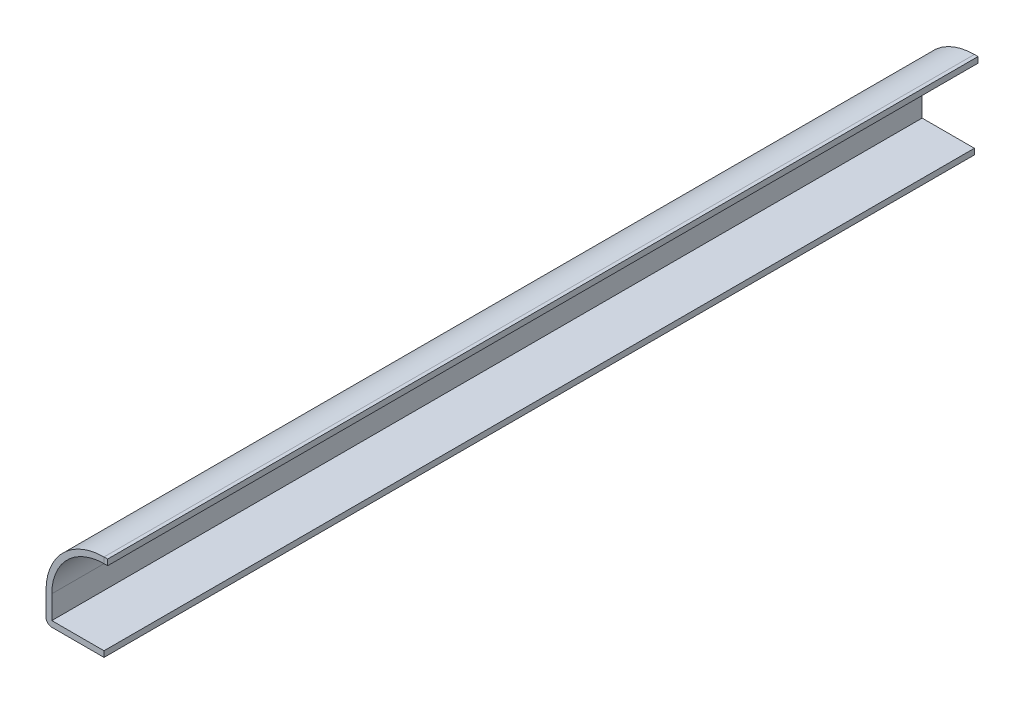
ISO-10303-21;
HEADER;
FILE_DESCRIPTION(('STEP AP214'),'2;1');
FILE_NAME('part.step','',(''),(''),'','','');
FILE_SCHEMA(('AUTOMOTIVE_DESIGN { 1 0 10303 214 1 1 1 1 }'));
ENDSEC;
DATA;
#1=APPLICATION_CONTEXT('core data for automotive mechanical design processes');
#2=APPLICATION_PROTOCOL_DEFINITION('international standard','automotive_design',2000,#1);
#3=PRODUCT_CONTEXT('',#1,'mechanical');
#4=PRODUCT('Part','Part','',(#3));
#5=PRODUCT_RELATED_PRODUCT_CATEGORY('part','',(#4));
#6=PRODUCT_DEFINITION_FORMATION('','',#4);
#7=PRODUCT_DEFINITION_CONTEXT('part definition',#1,'design');
#8=PRODUCT_DEFINITION('design','',#6,#7);
#9=PRODUCT_DEFINITION_SHAPE('','',#8);
#10=(LENGTH_UNIT() NAMED_UNIT(*) SI_UNIT(.MILLI.,.METRE.));
#11=(NAMED_UNIT(*) PLANE_ANGLE_UNIT() SI_UNIT($,.RADIAN.));
#12=(NAMED_UNIT(*) SI_UNIT($,.STERADIAN.) SOLID_ANGLE_UNIT());
#13=UNCERTAINTY_MEASURE_WITH_UNIT(LENGTH_MEASURE(1.E-05),#10,'distance_accuracy_value','');
#14=(GEOMETRIC_REPRESENTATION_CONTEXT(3) GLOBAL_UNCERTAINTY_ASSIGNED_CONTEXT((#13)) GLOBAL_UNIT_ASSIGNED_CONTEXT((#10,
#11,#12)) REPRESENTATION_CONTEXT('',''));
#15=CARTESIAN_POINT('',(0.,0.,0.));
#16=DIRECTION('',(0.,0.,1.));
#17=DIRECTION('',(1.,0.,0.));
#18=AXIS2_PLACEMENT_3D('',#15,#16,#17);
#19=CARTESIAN_POINT('',(0.,17.78,-190.5));
#20=DIRECTION('',(0.,-1.,0.));
#21=DIRECTION('',(1.,0.,0.));
#22=AXIS2_PLACEMENT_3D('',#19,#20,#21);
#23=PLANE('',#22);
#24=DIRECTION('',(1.,0.,0.));
#25=VECTOR('',#24,1.);
#26=CARTESIAN_POINT('',(0.,17.78,0.));
#27=LINE('',#26,#25);
#28=CARTESIAN_POINT('',(0.,17.78,0.));
#29=VERTEX_POINT('',#28);
#30=CARTESIAN_POINT('',(0.79374999999999,17.78,0.));
#31=VERTEX_POINT('',#30);
#32=EDGE_CURVE('E146',#29,#31,#27,.T.);
#33=ORIENTED_EDGE('',*,*,#32,.F.);
#34=DIRECTION('',(0.,0.,1.));
#35=VECTOR('',#34,1.);
#36=CARTESIAN_POINT('',(0.,17.78,-190.5));
#37=LINE('',#36,#35);
#38=CARTESIAN_POINT('',(0.,17.78,-190.5));
#39=VERTEX_POINT('',#38);
#40=EDGE_CURVE('E13',#39,#29,#37,.T.);
#41=ORIENTED_EDGE('',*,*,#40,.F.);
#42=DIRECTION('',(1.,0.,0.));
#43=VECTOR('',#42,1.);
#44=CARTESIAN_POINT('',(0.,17.78,-190.5));
#45=LINE('',#44,#43);
#46=CARTESIAN_POINT('',(0.79374999999999,17.78,-190.5));
#47=VERTEX_POINT('',#46);
#48=EDGE_CURVE('E141',#39,#47,#45,.T.);
#49=ORIENTED_EDGE('',*,*,#48,.T.);
#50=DIRECTION('',(0.,0.,1.));
#51=VECTOR('',#50,1.);
#52=CARTESIAN_POINT('',(0.79374999999999,17.78,-190.5));
#53=LINE('',#52,#51);
#54=EDGE_CURVE('E84',#47,#31,#53,.T.);
#55=ORIENTED_EDGE('',*,*,#54,.T.);
#56=EDGE_LOOP('',(#33,#41,#49,#55));
#57=FACE_BOUND('',#56,.T.);
#58=ADVANCED_FACE('F81',(#57),#23,.T.);
#59=CARTESIAN_POINT('',(0.,17.78,-190.5));
#60=DIRECTION('',(1.,0.,0.));
#61=DIRECTION('',(0.,1.,0.));
#62=AXIS2_PLACEMENT_3D('',#59,#60,#61);
#63=PLANE('',#62);
#64=DIRECTION('',(0.,1.,0.));
#65=VECTOR('',#64,1.);
#66=CARTESIAN_POINT('',(0.,17.78,0.));
#67=LINE('',#66,#65);
#68=CARTESIAN_POINT('',(0.,19.05,0.));
#69=VERTEX_POINT('',#68);
#70=EDGE_CURVE('E114',#29,#69,#67,.T.);
#71=ORIENTED_EDGE('',*,*,#70,.T.);
#72=DIRECTION('',(0.,0.,1.));
#73=VECTOR('',#72,1.);
#74=CARTESIAN_POINT('',(0.,19.05,-190.5));
#75=LINE('',#74,#73);
#76=CARTESIAN_POINT('',(0.,19.05,-190.5));
#77=VERTEX_POINT('',#76);
#78=EDGE_CURVE('E90',#77,#69,#75,.T.);
#79=ORIENTED_EDGE('',*,*,#78,.F.);
#80=DIRECTION('',(0.,1.,0.));
#81=VECTOR('',#80,1.);
#82=CARTESIAN_POINT('',(0.,17.78,-190.5));
#83=LINE('',#82,#81);
#84=EDGE_CURVE('E129',#39,#77,#83,.T.);
#85=ORIENTED_EDGE('',*,*,#84,.F.);
#86=ORIENTED_EDGE('',*,*,#40,.T.);
#87=EDGE_LOOP('',(#71,#79,#85,#86));
#88=FACE_BOUND('',#87,.T.);
#89=ADVANCED_FACE('F156',(#88),#63,.F.);
#90=CARTESIAN_POINT('',(0.,19.05,-190.5));
#91=DIRECTION('',(0.,-1.,0.));
#92=DIRECTION('',(1.,0.,0.));
#93=AXIS2_PLACEMENT_3D('',#90,#91,#92);
#94=PLANE('',#93);
#95=DIRECTION('',(1.,0.,0.));
#96=VECTOR('',#95,1.);
#97=CARTESIAN_POINT('',(0.,19.05,0.));
#98=LINE('',#97,#96);
#99=CARTESIAN_POINT('',(0.793749999999996,19.05,0.));
#100=VERTEX_POINT('',#99);
#101=EDGE_CURVE('E136',#69,#100,#98,.T.);
#102=ORIENTED_EDGE('',*,*,#101,.T.);
#103=DIRECTION('',(0.,0.,1.));
#104=VECTOR('',#103,1.);
#105=CARTESIAN_POINT('',(0.793749999999996,19.05,-190.5));
#106=LINE('',#105,#104);
#107=CARTESIAN_POINT('',(0.793749999999996,19.05,-190.5));
#108=VERTEX_POINT('',#107);
#109=EDGE_CURVE('E133',#108,#100,#106,.T.);
#110=ORIENTED_EDGE('',*,*,#109,.F.);
#111=DIRECTION('',(1.,0.,0.));
#112=VECTOR('',#111,1.);
#113=CARTESIAN_POINT('',(0.,19.05,-190.5));
#114=LINE('',#113,#112);
#115=EDGE_CURVE('E126',#77,#108,#114,.T.);
#116=ORIENTED_EDGE('',*,*,#115,.F.);
#117=ORIENTED_EDGE('',*,*,#78,.T.);
#118=EDGE_LOOP('',(#102,#110,#116,#117));
#119=FACE_BOUND('',#118,.T.);
#120=ADVANCED_FACE('F134',(#119),#94,.F.);
#121=CARTESIAN_POINT('',(0.793749999999996,19.05,-190.5));
#122=DIRECTION('',(-1.,0.,0.));
#123=DIRECTION('',(0.,-1.,0.));
#124=AXIS2_PLACEMENT_3D('',#121,#122,#123);
#125=PLANE('',#124);
#126=DIRECTION('',(0.,-1.,0.));
#127=VECTOR('',#126,1.);
#128=CARTESIAN_POINT('',(0.793749999999996,19.05,0.));
#129=LINE('',#128,#127);
#130=EDGE_CURVE('E149',#100,#31,#129,.T.);
#131=ORIENTED_EDGE('',*,*,#130,.T.);
#132=ORIENTED_EDGE('',*,*,#54,.F.);
#133=DIRECTION('',(0.,-1.,0.));
#134=VECTOR('',#133,1.);
#135=CARTESIAN_POINT('',(0.793749999999996,19.05,-190.5));
#136=LINE('',#135,#134);
#137=EDGE_CURVE('E123',#108,#47,#136,.T.);
#138=ORIENTED_EDGE('',*,*,#137,.F.);
#139=ORIENTED_EDGE('',*,*,#109,.T.);
#140=EDGE_LOOP('',(#131,#132,#138,#139));
#141=FACE_BOUND('',#140,.T.);
#142=ADVANCED_FACE('F140',(#141),#125,.F.);
#143=CARTESIAN_POINT('',(0.,0.,-190.5));
#144=DIRECTION('',(0.,0.,-1.));
#145=DIRECTION('',(-1.,0.,0.));
#146=AXIS2_PLACEMENT_3D('',#143,#144,#145);
#147=PLANE('',#146);
#148=ORIENTED_EDGE('',*,*,#48,.F.);
#149=ORIENTED_EDGE('',*,*,#84,.T.);
#150=ORIENTED_EDGE('',*,*,#115,.T.);
#151=ORIENTED_EDGE('',*,*,#137,.T.);
#152=EDGE_LOOP('',(#148,#149,#150,#151));
#153=FACE_BOUND('',#152,.T.);
#154=ADVANCED_FACE('F128',(#153),#147,.T.);
#155=CARTESIAN_POINT('',(0.,0.,0.));
#156=DIRECTION('',(0.,0.,-1.));
#157=DIRECTION('',(-1.,0.,0.));
#158=AXIS2_PLACEMENT_3D('',#155,#156,#157);
#159=PLANE('',#158);
#160=ORIENTED_EDGE('',*,*,#32,.T.);
#161=ORIENTED_EDGE('',*,*,#130,.F.);
#162=ORIENTED_EDGE('',*,*,#101,.F.);
#163=ORIENTED_EDGE('',*,*,#70,.F.);
#164=EDGE_LOOP('',(#160,#161,#162,#163));
#165=FACE_BOUND('',#164,.T.);
#166=ADVANCED_FACE('F154',(#165),#159,.F.);
#167=CLOSED_SHELL('',(#58,#89,#120,#142,#154,#166));
#168=MANIFOLD_SOLID_BREP('B2',#167);
#169=CARTESIAN_POINT('',(0.,6.35,-190.5));
#170=DIRECTION('',(0.,0.,1.));
#171=DIRECTION('',(1.,0.,0.));
#172=AXIS2_PLACEMENT_3D('',#169,#170,#171);
#173=CYLINDRICAL_SURFACE('',#172,11.43);
#174=CARTESIAN_POINT('',(0.,6.35,0.));
#175=DIRECTION('',(0.,0.,1.));
#176=DIRECTION('',(1.,0.,0.));
#177=AXIS2_PLACEMENT_3D('',#174,#175,#176);
#178=CIRCLE('',#177,11.43);
#179=CARTESIAN_POINT('',(-11.43,6.35,0.));
#180=VERTEX_POINT('',#179);
#181=CARTESIAN_POINT('',(0.,17.78,0.));
#182=VERTEX_POINT('',#181);
#183=EDGE_CURVE('E320',#180,#182,#178,.F.);
#184=ORIENTED_EDGE('',*,*,#183,.F.);
#185=DIRECTION('',(0.,0.,1.));
#186=VECTOR('',#185,1.);
#187=CARTESIAN_POINT('',(-11.43,6.35,-190.5));
#188=LINE('',#187,#186);
#189=CARTESIAN_POINT('',(-11.43,6.35,-190.5));
#190=VERTEX_POINT('',#189);
#191=EDGE_CURVE('E302',#190,#180,#188,.T.);
#192=ORIENTED_EDGE('',*,*,#191,.F.);
#193=CARTESIAN_POINT('',(0.,6.35,-190.5));
#194=DIRECTION('',(0.,0.,1.));
#195=DIRECTION('',(1.,0.,0.));
#196=AXIS2_PLACEMENT_3D('',#193,#194,#195);
#197=CIRCLE('',#196,11.43);
#198=CARTESIAN_POINT('',(0.,17.78,-190.5));
#199=VERTEX_POINT('',#198);
#200=EDGE_CURVE('E283',#190,#199,#197,.F.);
#201=ORIENTED_EDGE('',*,*,#200,.T.);
#202=DIRECTION('',(0.,0.,1.));
#203=VECTOR('',#202,1.);
#204=CARTESIAN_POINT('',(0.,17.78,-190.5));
#205=LINE('',#204,#203);
#206=EDGE_CURVE('E292',#199,#182,#205,.T.);
#207=ORIENTED_EDGE('',*,*,#206,.T.);
#208=EDGE_LOOP('',(#184,#192,#201,#207));
#209=FACE_BOUND('',#208,.T.);
#210=ADVANCED_FACE('F207',(#209),#173,.F.);
#211=CARTESIAN_POINT('',(-11.43,0.,-190.5));
#212=DIRECTION('',(1.,0.,0.));
#213=DIRECTION('',(0.,0.,-1.));
#214=AXIS2_PLACEMENT_3D('',#211,#212,#213);
#215=PLANE('',#214);
#216=DIRECTION('',(0.,1.,0.));
#217=VECTOR('',#216,1.);
#218=CARTESIAN_POINT('',(-11.43,0.,0.));
#219=LINE('',#218,#217);
#220=CARTESIAN_POINT('',(-11.43,1.27,0.));
#221=VERTEX_POINT('',#220);
#222=EDGE_CURVE('E303',#221,#180,#219,.T.);
#223=ORIENTED_EDGE('',*,*,#222,.F.);
#224=DIRECTION('',(0.,0.,1.));
#225=VECTOR('',#224,1.);
#226=CARTESIAN_POINT('',(-11.43,1.27,-190.5));
#227=LINE('',#226,#225);
#228=CARTESIAN_POINT('',(-11.43,1.27,-190.5));
#229=VERTEX_POINT('',#228);
#230=EDGE_CURVE('E335',#229,#221,#227,.T.);
#231=ORIENTED_EDGE('',*,*,#230,.F.);
#232=DIRECTION('',(0.,1.,0.));
#233=VECTOR('',#232,1.);
#234=CARTESIAN_POINT('',(-11.43,0.,-190.5));
#235=LINE('',#234,#233);
#236=EDGE_CURVE('E300',#229,#190,#235,.T.);
#237=ORIENTED_EDGE('',*,*,#236,.T.);
#238=ORIENTED_EDGE('',*,*,#191,.T.);
#239=EDGE_LOOP('',(#223,#231,#237,#238));
#240=FACE_BOUND('',#239,.T.);
#241=ADVANCED_FACE('F369',(#240),#215,.T.);
#242=CARTESIAN_POINT('',(0.,1.27,-190.5));
#243=DIRECTION('',(0.,1.,0.));
#244=DIRECTION('',(0.,0.,1.));
#245=AXIS2_PLACEMENT_3D('',#242,#243,#244);
#246=PLANE('',#245);
#247=DIRECTION('',(1.,0.,0.));
#248=VECTOR('',#247,1.);
#249=CARTESIAN_POINT('',(0.,1.27,0.));
#250=LINE('',#249,#248);
#251=CARTESIAN_POINT('',(0.,1.27,0.));
#252=VERTEX_POINT('',#251);
#253=EDGE_CURVE('E306',#252,#221,#250,.F.);
#254=ORIENTED_EDGE('',*,*,#253,.F.);
#255=DIRECTION('',(0.,0.,1.));
#256=VECTOR('',#255,1.);
#257=CARTESIAN_POINT('',(0.,1.27,-190.5));
#258=LINE('',#257,#256);
#259=CARTESIAN_POINT('',(0.,1.27,-190.5));
#260=VERTEX_POINT('',#259);
#261=EDGE_CURVE('E337',#260,#252,#258,.T.);
#262=ORIENTED_EDGE('',*,*,#261,.F.);
#263=DIRECTION('',(1.,0.,0.));
#264=VECTOR('',#263,1.);
#265=CARTESIAN_POINT('',(0.,1.27,-190.5));
#266=LINE('',#265,#264);
#267=EDGE_CURVE('E316',#260,#229,#266,.F.);
#268=ORIENTED_EDGE('',*,*,#267,.T.);
#269=ORIENTED_EDGE('',*,*,#230,.T.);
#270=EDGE_LOOP('',(#254,#262,#268,#269));
#271=FACE_BOUND('',#270,.T.);
#272=ADVANCED_FACE('F373',(#271),#246,.T.);
#273=CARTESIAN_POINT('',(0.,1.27,-190.5));
#274=DIRECTION('',(-1.,0.,0.));
#275=DIRECTION('',(0.,0.,1.));
#276=AXIS2_PLACEMENT_3D('',#273,#274,#275);
#277=PLANE('',#276);
#278=DIRECTION('',(0.,-1.,0.));
#279=VECTOR('',#278,1.);
#280=CARTESIAN_POINT('',(0.,1.27,0.));
#281=LINE('',#280,#279);
#282=CARTESIAN_POINT('',(0.,0.,0.));
#283=VERTEX_POINT('',#282);
#284=EDGE_CURVE('E329',#252,#283,#281,.T.);
#285=ORIENTED_EDGE('',*,*,#284,.T.);
#286=DIRECTION('',(0.,0.,1.));
#287=VECTOR('',#286,1.);
#288=CARTESIAN_POINT('',(0.,0.,-190.5));
#289=LINE('',#288,#287);
#290=CARTESIAN_POINT('',(0.,0.,-190.5));
#291=VERTEX_POINT('',#290);
#292=EDGE_CURVE('E339',#291,#283,#289,.T.);
#293=ORIENTED_EDGE('',*,*,#292,.F.);
#294=DIRECTION('',(0.,-1.,0.));
#295=VECTOR('',#294,1.);
#296=CARTESIAN_POINT('',(0.,1.27,-190.5));
#297=LINE('',#296,#295);
#298=EDGE_CURVE('E314',#260,#291,#297,.T.);
#299=ORIENTED_EDGE('',*,*,#298,.F.);
#300=ORIENTED_EDGE('',*,*,#261,.T.);
#301=EDGE_LOOP('',(#285,#293,#299,#300));
#302=FACE_BOUND('',#301,.T.);
#303=ADVANCED_FACE('F379',(#302),#277,.F.);
#304=CARTESIAN_POINT('',(0.,0.,-190.5));
#305=DIRECTION('',(0.,1.,0.));
#306=DIRECTION('',(0.,0.,1.));
#307=AXIS2_PLACEMENT_3D('',#304,#305,#306);
#308=PLANE('',#307);
#309=DIRECTION('',(-1.,0.,0.));
#310=VECTOR('',#309,1.);
#311=CARTESIAN_POINT('',(0.,0.,0.));
#312=LINE('',#311,#310);
#313=CARTESIAN_POINT('',(-11.43,0.,0.));
#314=VERTEX_POINT('',#313);
#315=EDGE_CURVE('E327',#283,#314,#312,.T.);
#316=ORIENTED_EDGE('',*,*,#315,.T.);
#317=DIRECTION('',(0.,0.,1.));
#318=VECTOR('',#317,1.);
#319=CARTESIAN_POINT('',(-11.43,0.,-190.5));
#320=LINE('',#319,#318);
#321=CARTESIAN_POINT('',(-11.43,0.,-190.5));
#322=VERTEX_POINT('',#321);
#323=EDGE_CURVE('E215',#314,#322,#320,.F.);
#324=ORIENTED_EDGE('',*,*,#323,.T.);
#325=DIRECTION('',(-1.,0.,0.));
#326=VECTOR('',#325,1.);
#327=CARTESIAN_POINT('',(0.,0.,-190.5));
#328=LINE('',#327,#326);
#329=EDGE_CURVE('E312',#291,#322,#328,.T.);
#330=ORIENTED_EDGE('',*,*,#329,.F.);
#331=ORIENTED_EDGE('',*,*,#292,.T.);
#332=EDGE_LOOP('',(#316,#324,#330,#331));
#333=FACE_BOUND('',#332,.T.);
#334=ADVANCED_FACE('F366',(#333),#308,.F.);
#335=CARTESIAN_POINT('',(-12.7,0.,-190.5));
#336=DIRECTION('',(1.,0.,0.));
#337=DIRECTION('',(0.,0.,-1.));
#338=AXIS2_PLACEMENT_3D('',#335,#336,#337);
#339=PLANE('',#338);
#340=DIRECTION('',(0.,1.,0.));
#341=VECTOR('',#340,1.);
#342=CARTESIAN_POINT('',(-12.7,0.,-190.5));
#343=LINE('',#342,#341);
#344=CARTESIAN_POINT('',(-12.7,1.27,-190.5));
#345=VERTEX_POINT('',#344);
#346=CARTESIAN_POINT('',(-12.7,6.35,-190.5));
#347=VERTEX_POINT('',#346);
#348=EDGE_CURVE('E310',#345,#347,#343,.T.);
#349=ORIENTED_EDGE('',*,*,#348,.F.);
#350=DIRECTION('',(0.,0.,1.));
#351=VECTOR('',#350,1.);
#352=CARTESIAN_POINT('',(-12.7,1.27,-190.5));
#353=LINE('',#352,#351);
#354=CARTESIAN_POINT('',(-12.7,1.27,0.));
#355=VERTEX_POINT('',#354);
#356=EDGE_CURVE('E334',#345,#355,#353,.T.);
#357=ORIENTED_EDGE('',*,*,#356,.T.);
#358=DIRECTION('',(0.,1.,0.));
#359=VECTOR('',#358,1.);
#360=CARTESIAN_POINT('',(-12.7,0.,0.));
#361=LINE('',#360,#359);
#362=CARTESIAN_POINT('',(-12.7,6.35,0.));
#363=VERTEX_POINT('',#362);
#364=EDGE_CURVE('E325',#355,#363,#361,.T.);
#365=ORIENTED_EDGE('',*,*,#364,.T.);
#366=DIRECTION('',(0.,0.,1.));
#367=VECTOR('',#366,1.);
#368=CARTESIAN_POINT('',(-12.7,6.35,-190.5));
#369=LINE('',#368,#367);
#370=EDGE_CURVE('E342',#347,#363,#369,.T.);
#371=ORIENTED_EDGE('',*,*,#370,.F.);
#372=EDGE_LOOP('',(#349,#357,#365,#371));
#373=FACE_BOUND('',#372,.T.);
#374=ADVANCED_FACE('F351',(#373),#339,.F.);
#375=CARTESIAN_POINT('',(0.,6.35,-190.5));
#376=DIRECTION('',(0.,0.,1.));
#377=DIRECTION('',(1.,0.,0.));
#378=AXIS2_PLACEMENT_3D('',#375,#376,#377);
#379=CYLINDRICAL_SURFACE('',#378,12.7);
#380=CARTESIAN_POINT('',(0.,6.35,0.));
#381=DIRECTION('',(0.,0.,-1.));
#382=DIRECTION('',(-1.,0.,0.));
#383=AXIS2_PLACEMENT_3D('',#380,#381,#382);
#384=CIRCLE('',#383,12.7);
#385=CARTESIAN_POINT('',(0.,19.05,0.));
#386=VERTEX_POINT('',#385);
#387=EDGE_CURVE('E323',#363,#386,#384,.T.);
#388=ORIENTED_EDGE('',*,*,#387,.T.);
#389=DIRECTION('',(0.,0.,1.));
#390=VECTOR('',#389,1.);
#391=CARTESIAN_POINT('',(0.,19.05,-190.5));
#392=LINE('',#391,#390);
#393=CARTESIAN_POINT('',(0.,19.05,-190.5));
#394=VERTEX_POINT('',#393);
#395=EDGE_CURVE('E299',#394,#386,#392,.T.);
#396=ORIENTED_EDGE('',*,*,#395,.F.);
#397=CARTESIAN_POINT('',(0.,6.35,-190.5));
#398=DIRECTION('',(0.,0.,-1.));
#399=DIRECTION('',(-1.,0.,0.));
#400=AXIS2_PLACEMENT_3D('',#397,#398,#399);
#401=CIRCLE('',#400,12.7);
#402=EDGE_CURVE('E286',#347,#394,#401,.T.);
#403=ORIENTED_EDGE('',*,*,#402,.F.);
#404=ORIENTED_EDGE('',*,*,#370,.T.);
#405=EDGE_LOOP('',(#388,#396,#403,#404));
#406=FACE_BOUND('',#405,.T.);
#407=ADVANCED_FACE('F358',(#406),#379,.T.);
#408=CARTESIAN_POINT('',(0.,19.05,-190.5));
#409=DIRECTION('',(-1.,0.,0.));
#410=DIRECTION('',(0.,-1.,0.));
#411=AXIS2_PLACEMENT_3D('',#408,#409,#410);
#412=PLANE('',#411);
#413=DIRECTION('',(0.,-1.,0.));
#414=VECTOR('',#413,1.);
#415=CARTESIAN_POINT('',(0.,19.05,0.));
#416=LINE('',#415,#414);
#417=EDGE_CURVE('E295',#386,#182,#416,.T.);
#418=ORIENTED_EDGE('',*,*,#417,.T.);
#419=ORIENTED_EDGE('',*,*,#206,.F.);
#420=DIRECTION('',(0.,-1.,0.));
#421=VECTOR('',#420,1.);
#422=CARTESIAN_POINT('',(0.,19.05,-190.5));
#423=LINE('',#422,#421);
#424=EDGE_CURVE('E278',#394,#199,#423,.T.);
#425=ORIENTED_EDGE('',*,*,#424,.F.);
#426=ORIENTED_EDGE('',*,*,#395,.T.);
#427=EDGE_LOOP('',(#418,#419,#425,#426));
#428=FACE_BOUND('',#427,.T.);
#429=ADVANCED_FACE('F293',(#428),#412,.F.);
#430=CARTESIAN_POINT('',(0.,6.35,-190.5));
#431=DIRECTION('',(0.,0.,1.));
#432=DIRECTION('',(1.,0.,0.));
#433=AXIS2_PLACEMENT_3D('',#430,#431,#432);
#434=PLANE('',#433);
#435=ORIENTED_EDGE('',*,*,#329,.T.);
#436=CARTESIAN_POINT('',(-11.43,1.27,-190.5));
#437=DIRECTION('',(0.,0.,1.));
#438=DIRECTION('',(1.,0.,0.));
#439=AXIS2_PLACEMENT_3D('',#436,#437,#438);
#440=CIRCLE('',#439,1.27);
#441=EDGE_CURVE('E79',#322,#345,#440,.F.);
#442=ORIENTED_EDGE('',*,*,#441,.T.);
#443=ORIENTED_EDGE('',*,*,#348,.T.);
#444=ORIENTED_EDGE('',*,*,#402,.T.);
#445=ORIENTED_EDGE('',*,*,#424,.T.);
#446=ORIENTED_EDGE('',*,*,#200,.F.);
#447=ORIENTED_EDGE('',*,*,#236,.F.);
#448=ORIENTED_EDGE('',*,*,#267,.F.);
#449=ORIENTED_EDGE('',*,*,#298,.T.);
#450=EDGE_LOOP('',(#435,#442,#443,#444,#445,#446,#447,#448,#449));
#451=FACE_BOUND('',#450,.T.);
#452=ADVANCED_FACE('F280',(#451),#434,.F.);
#453=CARTESIAN_POINT('',(0.,6.35,0.));
#454=DIRECTION('',(0.,0.,1.));
#455=DIRECTION('',(1.,0.,0.));
#456=AXIS2_PLACEMENT_3D('',#453,#454,#455);
#457=PLANE('',#456);
#458=ORIENTED_EDGE('',*,*,#364,.F.);
#459=CARTESIAN_POINT('',(-11.43,1.27,0.));
#460=DIRECTION('',(0.,0.,1.));
#461=DIRECTION('',(1.,0.,0.));
#462=AXIS2_PLACEMENT_3D('',#459,#460,#461);
#463=CIRCLE('',#462,1.27);
#464=EDGE_CURVE('E229',#355,#314,#463,.T.);
#465=ORIENTED_EDGE('',*,*,#464,.T.);
#466=ORIENTED_EDGE('',*,*,#315,.F.);
#467=ORIENTED_EDGE('',*,*,#284,.F.);
#468=ORIENTED_EDGE('',*,*,#253,.T.);
#469=ORIENTED_EDGE('',*,*,#222,.T.);
#470=ORIENTED_EDGE('',*,*,#183,.T.);
#471=ORIENTED_EDGE('',*,*,#417,.F.);
#472=ORIENTED_EDGE('',*,*,#387,.F.);
#473=EDGE_LOOP('',(#458,#465,#466,#467,#468,#469,#470,#471,#472));
#474=FACE_BOUND('',#473,.T.);
#475=ADVANCED_FACE('F356',(#474),#457,.T.);
#476=CARTESIAN_POINT('',(-11.43,1.27,-190.5));
#477=DIRECTION('',(0.,0.,1.));
#478=DIRECTION('',(1.,0.,0.));
#479=AXIS2_PLACEMENT_3D('',#476,#477,#478);
#480=CYLINDRICAL_SURFACE('',#479,1.27);
#481=ORIENTED_EDGE('',*,*,#441,.F.);
#482=ORIENTED_EDGE('',*,*,#323,.F.);
#483=ORIENTED_EDGE('',*,*,#464,.F.);
#484=ORIENTED_EDGE('',*,*,#356,.F.);
#485=EDGE_LOOP('',(#481,#482,#483,#484));
#486=FACE_BOUND('',#485,.T.);
#487=ADVANCED_FACE('F209',(#486),#480,.T.);
#488=CLOSED_SHELL('',(#210,#241,#272,#303,#334,#374,#407,#429,#452,#475,#487));
#489=MANIFOLD_SOLID_BREP('B7',#488);
#490=ADVANCED_BREP_SHAPE_REPRESENTATION('',(#18,#168,#489),#14);
#491=SHAPE_DEFINITION_REPRESENTATION(#9,#490);
ENDSEC;
END-ISO-10303-21;
